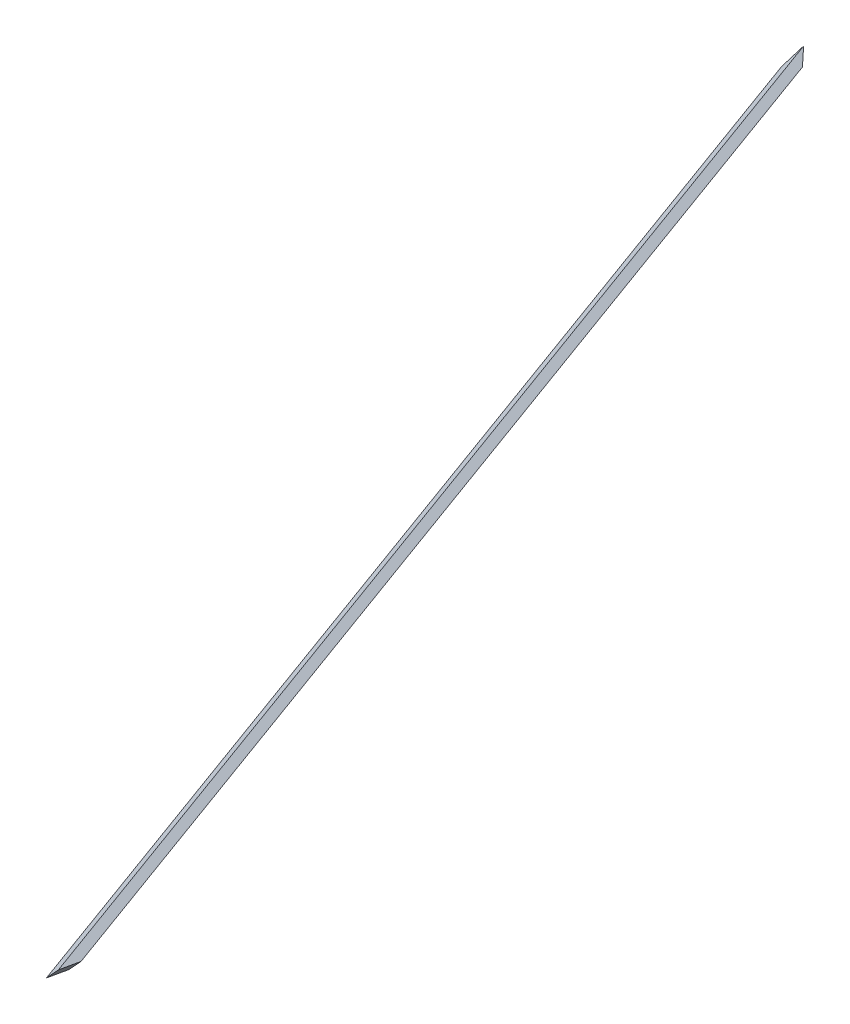
ISO-10303-21;
HEADER;
FILE_DESCRIPTION(('STEP AP214'),'2;1');
FILE_NAME('part.step','',(''),(''),'','','');
FILE_SCHEMA(('AUTOMOTIVE_DESIGN { 1 0 10303 214 1 1 1 1 }'));
ENDSEC;
DATA;
#1=APPLICATION_CONTEXT('core data for automotive mechanical design processes');
#2=APPLICATION_PROTOCOL_DEFINITION('international standard','automotive_design',2000,#1);
#3=PRODUCT_CONTEXT('',#1,'mechanical');
#4=PRODUCT('Part','Part','',(#3));
#5=PRODUCT_RELATED_PRODUCT_CATEGORY('part','',(#4));
#6=PRODUCT_DEFINITION_FORMATION('','',#4);
#7=PRODUCT_DEFINITION_CONTEXT('part definition',#1,'design');
#8=PRODUCT_DEFINITION('design','',#6,#7);
#9=PRODUCT_DEFINITION_SHAPE('','',#8);
#10=(LENGTH_UNIT() NAMED_UNIT(*) SI_UNIT(.MILLI.,.METRE.));
#11=(NAMED_UNIT(*) PLANE_ANGLE_UNIT() SI_UNIT($,.RADIAN.));
#12=(NAMED_UNIT(*) SI_UNIT($,.STERADIAN.) SOLID_ANGLE_UNIT());
#13=UNCERTAINTY_MEASURE_WITH_UNIT(LENGTH_MEASURE(1.E-05),#10,'distance_accuracy_value','');
#14=(GEOMETRIC_REPRESENTATION_CONTEXT(3) GLOBAL_UNCERTAINTY_ASSIGNED_CONTEXT((#13)) GLOBAL_UNIT_ASSIGNED_CONTEXT((#10,
#11,#12)) REPRESENTATION_CONTEXT('',''));
#15=CARTESIAN_POINT('',(0.,0.,0.));
#16=DIRECTION('',(0.,0.,1.));
#17=DIRECTION('',(1.,0.,0.));
#18=AXIS2_PLACEMENT_3D('',#15,#16,#17);
#19=CARTESIAN_POINT('',(0.,0.,0.));
#20=DIRECTION('',(-0.467086179481357,0.356822089773095,0.809016994374946));
#21=DIRECTION('',(0.866025403784439,0.,0.5));
#22=AXIS2_PLACEMENT_3D('',#19,#20,#21);
#23=PLANE('',#22);
#24=DIRECTION('',(-0.607061998206685,-0.794654472291767,0.));
#25=VECTOR('',#24,1.);
#26=CARTESIAN_POINT('',(27.1270322111974,-20.7232085815281,24.8019022697577));
#27=LINE('',#26,#25);
#28=CARTESIAN_POINT('',(4577.27924741556,5935.50336811369,24.8019022697559));
#29=VERTEX_POINT('',#28);
#30=CARTESIAN_POINT('',(4515.13685118347,5854.15791537471,24.8019022697559));
#31=VERTEX_POINT('',#30);
#32=EDGE_CURVE('E12',#29,#31,#27,.T.);
#33=ORIENTED_EDGE('',*,*,#32,.T.);
#34=DIRECTION('',(0.498272048507418,-0.649629504367773,0.574200725122412));
#35=VECTOR('',#34,1.);
#36=CARTESIAN_POINT('',(5281.99046233048,4854.36125243857,908.511716822593));
#37=LINE('',#36,#35);
#38=CARTESIAN_POINT('',(4493.61459579409,5882.21787206575,0.));
#39=VERTEX_POINT('',#38);
#40=EDGE_CURVE('E90',#39,#31,#37,.T.);
#41=ORIENTED_EDGE('',*,*,#40,.F.);
#42=DIRECTION('',(-0.607061998206687,-0.794654472291765,0.));
#43=VECTOR('',#42,1.);
#44=CARTESIAN_POINT('',(0.,0.,0.));
#45=LINE('',#44,#43);
#46=CARTESIAN_POINT('',(4555.75699202616,5963.56332480476,-1.03270126086879E-12));
#47=VERTEX_POINT('',#46);
#48=EDGE_CURVE('E86',#47,#39,#45,.T.);
#49=ORIENTED_EDGE('',*,*,#48,.F.);
#50=DIRECTION('',(-0.498272048507418,0.649629504367773,-0.574200725122412));
#51=VECTOR('',#50,1.);
#52=CARTESIAN_POINT('',(5355.03534350731,4921.49243024031,921.07556578755));
#53=LINE('',#52,#51);
#54=EDGE_CURVE('E95',#29,#47,#53,.T.);
#55=ORIENTED_EDGE('',*,*,#54,.F.);
#56=EDGE_LOOP('',(#33,#41,#49,#55));
#57=FACE_BOUND('',#56,.T.);
#58=ADVANCED_FACE('F45',(#57),#23,.F.);
#59=CARTESIAN_POINT('',(0.,0.,0.));
#60=DIRECTION('',(0.67911581020158,-0.720031948532649,0.142673436303081));
#61=DIRECTION('',(0.727474142160718,0.686135097839723,0.));
#62=AXIS2_PLACEMENT_3D('',#59,#60,#61);
#63=PLANE('',#62);
#64=DIRECTION('',(-0.654469130781616,-0.6819697127199,-0.3264773618288));
#65=VECTOR('',#64,1.);
#66=CARTESIAN_POINT('',(17.6961461117427,6.83308507856986,-49.7478242931787));
#67=LINE('',#66,#65);
#68=CARTESIAN_POINT('',(4921.67897900531,5116.87969604348,2396.56981306389));
#69=VERTEX_POINT('',#68);
#70=CARTESIAN_POINT('',(4854.68371300802,5047.06931056174,2363.14969182503));
#71=VERTEX_POINT('',#70);
#72=EDGE_CURVE('E53',#69,#71,#67,.T.);
#73=ORIENTED_EDGE('',*,*,#72,.F.);
#74=DIRECTION('',(-0.186329447477916,0.0189014194816005,0.982305488808932));
#75=VECTOR('',#74,1.);
#76=CARTESIAN_POINT('',(5207.47597603096,5087.88820274769,889.883872310094));
#77=LINE('',#76,#75);
#78=CARTESIAN_POINT('',(4911.52852168568,5117.90936716807,2450.08175158974));
#79=VERTEX_POINT('',#78);
#80=EDGE_CURVE('E111',#69,#79,#77,.T.);
#81=ORIENTED_EDGE('',*,*,#80,.T.);
#82=DIRECTION('',(-0.654469130781616,-0.681969712719901,-0.326477361828797));
#83=VECTOR('',#82,1.);
#84=CARTESIAN_POINT('',(0.,0.,0.));
#85=LINE('',#84,#83);
#86=CARTESIAN_POINT('',(4844.53325568839,5048.09898168633,2416.66163035087));
#87=VERTEX_POINT('',#86);
#88=EDGE_CURVE('E104',#79,#87,#85,.T.);
#89=ORIENTED_EDGE('',*,*,#88,.T.);
#90=DIRECTION('',(0.186329447477916,-0.0189014194816003,-0.982305488808932));
#91=VECTOR('',#90,1.);
#92=CARTESIAN_POINT('',(5136.44386522303,5018.4873182771,877.745490853307));
#93=LINE('',#92,#91);
#94=EDGE_CURVE('E99',#87,#71,#93,.T.);
#95=ORIENTED_EDGE('',*,*,#94,.T.);
#96=EDGE_LOOP('',(#73,#81,#89,#95));
#97=FACE_BOUND('',#96,.T.);
#98=ADVANCED_FACE('F118',(#97),#63,.T.);
#99=CARTESIAN_POINT('',(18.7443182509808,-14.3193849518594,-7.66420929418161));
#100=DIRECTION('',(0.755761314076171,-0.577350269189627,-0.309016994374945));
#101=DIRECTION('',(0.607061998206687,0.794654472291766,0.));
#102=AXIS2_PLACEMENT_3D('',#99,#100,#101);
#103=PLANE('',#102);
#104=ORIENTED_EDGE('',*,*,#32,.F.);
#105=DIRECTION('',(0.135986879800864,-0.323235091915093,0.936497006870106));
#106=VECTOR('',#105,1.);
#107=CARTESIAN_POINT('',(4750.37506284441,5524.06189749386,1216.85596872293));
#108=LINE('',#107,#106);
#109=EDGE_CURVE('E48',#29,#69,#108,.T.);
#110=ORIENTED_EDGE('',*,*,#109,.T.);
#111=ORIENTED_EDGE('',*,*,#72,.T.);
#112=DIRECTION('',(-0.135986879800864,0.323235091915093,-0.936497006870106));
#113=VECTOR('',#112,1.);
#114=CARTESIAN_POINT('',(4685.80623172972,5448.4839783835,1200.1459081035));
#115=LINE('',#114,#113);
#116=EDGE_CURVE('E106',#71,#31,#115,.T.);
#117=ORIENTED_EDGE('',*,*,#116,.T.);
#118=EDGE_LOOP('',(#104,#110,#111,#117));
#119=FACE_BOUND('',#118,.T.);
#120=ADVANCED_FACE('F117',(#119),#103,.T.);
#121=CARTESIAN_POINT('',(0.,0.,0.));
#122=DIRECTION('',(0.755761314076171,-0.577350269189627,-0.309016994374945));
#123=DIRECTION('',(0.607061998206687,0.794654472291765,0.));
#124=AXIS2_PLACEMENT_3D('',#121,#122,#123);
#125=PLANE('',#124);
#126=ORIENTED_EDGE('',*,*,#48,.T.);
#127=DIRECTION('',(0.135986879800864,-0.323235091915093,0.936497006870106));
#128=VECTOR('',#127,1.);
#129=CARTESIAN_POINT('',(4669.07392574124,5465.15842687605,1208.33081517543));
#130=LINE('',#129,#128);
#131=EDGE_CURVE('E61',#39,#87,#130,.T.);
#132=ORIENTED_EDGE('',*,*,#131,.T.);
#133=ORIENTED_EDGE('',*,*,#88,.F.);
#134=DIRECTION('',(0.135986879800867,-0.323235091915095,0.936497006870105));
#135=VECTOR('',#134,1.);
#136=CARTESIAN_POINT('',(4733.64275685592,5540.73634598641,1225.04087579486));
#137=LINE('',#136,#135);
#138=EDGE_CURVE('E69',#47,#79,#137,.T.);
#139=ORIENTED_EDGE('',*,*,#138,.F.);
#140=EDGE_LOOP('',(#126,#132,#133,#139));
#141=FACE_BOUND('',#140,.T.);
#142=ADVANCED_FACE('F88',(#141),#125,.F.);
#143=CARTESIAN_POINT('',(5281.99046233046,4854.36125243859,908.511716822625));
#144=DIRECTION('',(0.730448811768304,0.671311778017372,0.125638489649577));
#145=DIRECTION('',(-0.676673678812601,0.736283051823292,0.));
#146=AXIS2_PLACEMENT_3D('',#143,#144,#145);
#147=PLANE('',#146);
#148=ORIENTED_EDGE('',*,*,#116,.F.);
#149=ORIENTED_EDGE('',*,*,#94,.F.);
#150=ORIENTED_EDGE('',*,*,#131,.F.);
#151=ORIENTED_EDGE('',*,*,#40,.T.);
#152=EDGE_LOOP('',(#148,#149,#150,#151));
#153=FACE_BOUND('',#152,.T.);
#154=ADVANCED_FACE('F97',(#153),#147,.F.);
#155=CARTESIAN_POINT('',(5355.03534350729,4921.49243024033,921.075565787583));
#156=DIRECTION('',(-0.730448811768304,-0.671311778017372,-0.125638489649577));
#157=DIRECTION('',(0.676673678812601,-0.736283051823292,0.));
#158=AXIS2_PLACEMENT_3D('',#155,#156,#157);
#159=PLANE('',#158);
#160=ORIENTED_EDGE('',*,*,#80,.F.);
#161=ORIENTED_EDGE('',*,*,#109,.F.);
#162=ORIENTED_EDGE('',*,*,#54,.T.);
#163=ORIENTED_EDGE('',*,*,#138,.T.);
#164=EDGE_LOOP('',(#160,#161,#162,#163));
#165=FACE_BOUND('',#164,.T.);
#166=ADVANCED_FACE('F120',(#165),#159,.F.);
#167=CLOSED_SHELL('',(#58,#98,#120,#142,#154,#166));
#168=MANIFOLD_SOLID_BREP('B2',#167);
#169=ADVANCED_BREP_SHAPE_REPRESENTATION('',(#18,#168),#14);
#170=SHAPE_DEFINITION_REPRESENTATION(#9,#169);
ENDSEC;
END-ISO-10303-21;
